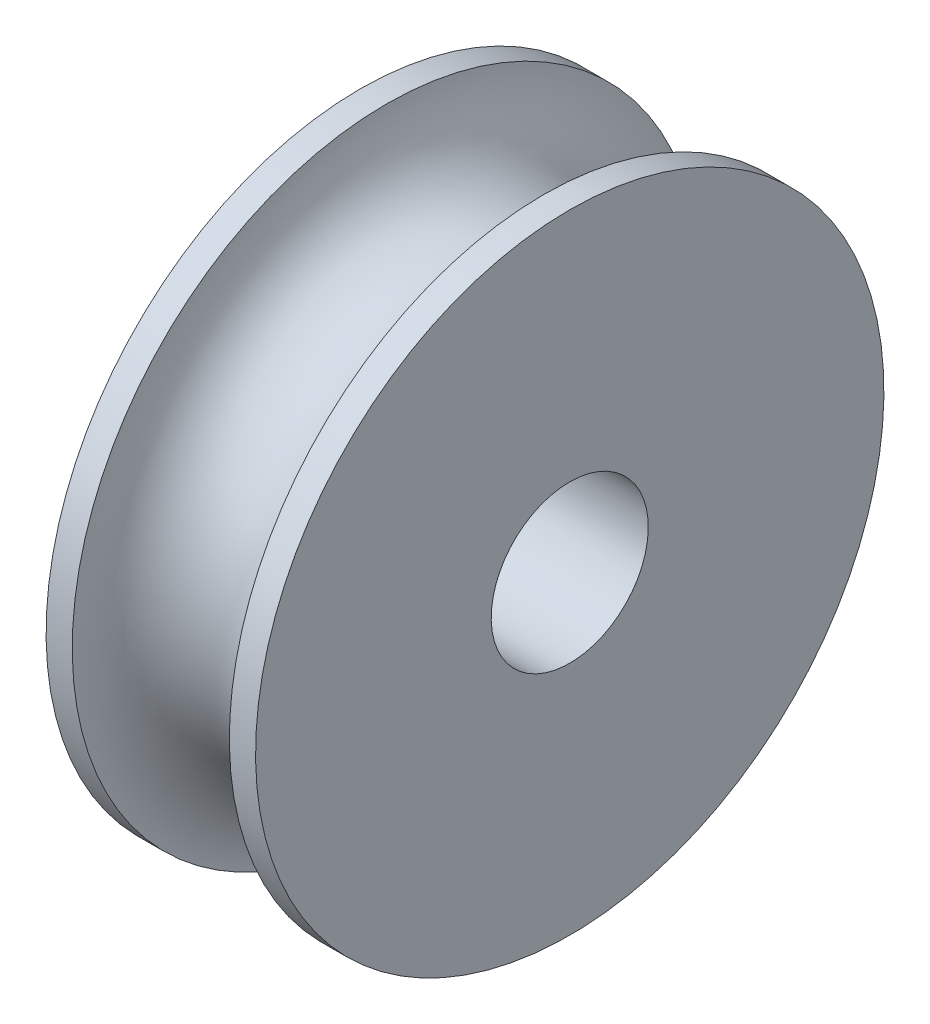
ISO-10303-21;
HEADER;
FILE_DESCRIPTION(('STEP AP214'),'2;1');
FILE_NAME('part.step','',(''),(''),'','','');
FILE_SCHEMA(('AUTOMOTIVE_DESIGN { 1 0 10303 214 1 1 1 1 }'));
ENDSEC;
DATA;
#1=APPLICATION_CONTEXT('core data for automotive mechanical design processes');
#2=APPLICATION_PROTOCOL_DEFINITION('international standard','automotive_design',2000,#1);
#3=PRODUCT_CONTEXT('',#1,'mechanical');
#4=PRODUCT('Part','Part','',(#3));
#5=PRODUCT_RELATED_PRODUCT_CATEGORY('part','',(#4));
#6=PRODUCT_DEFINITION_FORMATION('','',#4);
#7=PRODUCT_DEFINITION_CONTEXT('part definition',#1,'design');
#8=PRODUCT_DEFINITION('design','',#6,#7);
#9=PRODUCT_DEFINITION_SHAPE('','',#8);
#10=(LENGTH_UNIT() NAMED_UNIT(*) SI_UNIT(.MILLI.,.METRE.));
#11=(NAMED_UNIT(*) PLANE_ANGLE_UNIT() SI_UNIT($,.RADIAN.));
#12=(NAMED_UNIT(*) SI_UNIT($,.STERADIAN.) SOLID_ANGLE_UNIT());
#13=UNCERTAINTY_MEASURE_WITH_UNIT(LENGTH_MEASURE(1.E-05),#10,'distance_accuracy_value','');
#14=(GEOMETRIC_REPRESENTATION_CONTEXT(3) GLOBAL_UNCERTAINTY_ASSIGNED_CONTEXT((#13)) GLOBAL_UNIT_ASSIGNED_CONTEXT((#10,
#11,#12)) REPRESENTATION_CONTEXT('',''));
#15=CARTESIAN_POINT('',(0.,0.,0.));
#16=DIRECTION('',(0.,0.,1.));
#17=DIRECTION('',(1.,0.,0.));
#18=AXIS2_PLACEMENT_3D('',#15,#16,#17);
#19=CARTESIAN_POINT('',(0.,0.,0.));
#20=DIRECTION('',(1.,0.,0.));
#21=DIRECTION('',(0.,1.,0.));
#22=AXIS2_PLACEMENT_3D('',#19,#20,#21);
#23=PLANE('',#22);
#24=CARTESIAN_POINT('',(0.,0.,0.));
#25=DIRECTION('',(1.,0.,0.));
#26=DIRECTION('',(0.,1.,0.));
#27=AXIS2_PLACEMENT_3D('',#24,#25,#26);
#28=CIRCLE('',#27,1.5);
#29=CARTESIAN_POINT('',(0.,1.5,0.));
#30=VERTEX_POINT('',#29);
#31=EDGE_CURVE('E60',#30,#30,#28,.T.);
#32=ORIENTED_EDGE('',*,*,#31,.F.);
#33=EDGE_LOOP('',(#32));
#34=FACE_BOUND('',#33,.T.);
#35=CARTESIAN_POINT('',(0.,0.,0.));
#36=DIRECTION('',(1.,0.,0.));
#37=DIRECTION('',(0.,1.,0.));
#38=AXIS2_PLACEMENT_3D('',#35,#36,#37);
#39=CIRCLE('',#38,6.);
#40=CARTESIAN_POINT('',(0.,6.,0.));
#41=VERTEX_POINT('',#40);
#42=EDGE_CURVE('E56',#41,#41,#39,.T.);
#43=ORIENTED_EDGE('',*,*,#42,.T.);
#44=EDGE_LOOP('',(#43));
#45=FACE_BOUND('',#44,.T.);
#46=ADVANCED_FACE('F37',(#34,#45),#23,.T.);
#47=CARTESIAN_POINT('',(-4.,0.,0.));
#48=DIRECTION('',(-1.,0.,0.));
#49=DIRECTION('',(0.,-1.,0.));
#50=AXIS2_PLACEMENT_3D('',#47,#48,#49);
#51=PLANE('',#50);
#52=CARTESIAN_POINT('',(-4.,0.,0.));
#53=DIRECTION('',(-1.,0.,0.));
#54=DIRECTION('',(0.,-1.,0.));
#55=AXIS2_PLACEMENT_3D('',#52,#53,#54);
#56=CIRCLE('',#55,1.5);
#57=CARTESIAN_POINT('',(-4.,-1.5,0.));
#58=VERTEX_POINT('',#57);
#59=EDGE_CURVE('E40',#58,#58,#56,.T.);
#60=ORIENTED_EDGE('',*,*,#59,.F.);
#61=EDGE_LOOP('',(#60));
#62=FACE_BOUND('',#61,.T.);
#63=CARTESIAN_POINT('',(-4.,0.,0.));
#64=DIRECTION('',(1.,0.,0.));
#65=DIRECTION('',(0.,1.,0.));
#66=AXIS2_PLACEMENT_3D('',#63,#64,#65);
#67=CIRCLE('',#66,6.);
#68=CARTESIAN_POINT('',(-4.,6.,0.));
#69=VERTEX_POINT('',#68);
#70=EDGE_CURVE('E10',#69,#69,#67,.T.);
#71=ORIENTED_EDGE('',*,*,#70,.F.);
#72=EDGE_LOOP('',(#71));
#73=FACE_BOUND('',#72,.T.);
#74=ADVANCED_FACE('F71',(#62,#73),#51,.T.);
#75=CARTESIAN_POINT('',(0.,0.,0.));
#76=DIRECTION('',(1.,0.,0.));
#77=DIRECTION('',(0.,1.,0.));
#78=AXIS2_PLACEMENT_3D('',#75,#76,#77);
#79=CYLINDRICAL_SURFACE('',#78,6.);
#80=ORIENTED_EDGE('',*,*,#70,.T.);
#81=EDGE_LOOP('',(#80));
#82=FACE_BOUND('',#81,.T.);
#83=CARTESIAN_POINT('',(-3.5,0.,0.));
#84=DIRECTION('',(1.,0.,0.));
#85=DIRECTION('',(0.,1.,0.));
#86=AXIS2_PLACEMENT_3D('',#83,#84,#85);
#87=CIRCLE('',#86,6.);
#88=CARTESIAN_POINT('',(-3.5,6.,0.));
#89=VERTEX_POINT('',#88);
#90=EDGE_CURVE('E45',#89,#89,#87,.T.);
#91=ORIENTED_EDGE('',*,*,#90,.F.);
#92=EDGE_LOOP('',(#91));
#93=FACE_BOUND('',#92,.T.);
#94=ADVANCED_FACE('F74',(#82,#93),#79,.T.);
#95=CARTESIAN_POINT('',(-2.,0.,0.));
#96=DIRECTION('',(1.,0.,0.));
#97=DIRECTION('',(0.,1.,0.));
#98=AXIS2_PLACEMENT_3D('',#95,#96,#97);
#99=TOROIDAL_SURFACE('',#98,6.,1.5);
#100=ORIENTED_EDGE('',*,*,#90,.T.);
#101=EDGE_LOOP('',(#100));
#102=FACE_BOUND('',#101,.T.);
#103=CARTESIAN_POINT('',(-0.499999999999999,0.,0.));
#104=DIRECTION('',(1.,0.,0.));
#105=DIRECTION('',(0.,1.,0.));
#106=AXIS2_PLACEMENT_3D('',#103,#104,#105);
#107=CIRCLE('',#106,6.);
#108=CARTESIAN_POINT('',(-0.5,6.,0.));
#109=VERTEX_POINT('',#108);
#110=EDGE_CURVE('E50',#109,#109,#107,.T.);
#111=ORIENTED_EDGE('',*,*,#110,.F.);
#112=EDGE_LOOP('',(#111));
#113=FACE_BOUND('',#112,.T.);
#114=ADVANCED_FACE('F79',(#102,#113),#99,.F.);
#115=CARTESIAN_POINT('',(0.,0.,0.));
#116=DIRECTION('',(1.,0.,0.));
#117=DIRECTION('',(0.,1.,0.));
#118=AXIS2_PLACEMENT_3D('',#115,#116,#117);
#119=CYLINDRICAL_SURFACE('',#118,6.);
#120=ORIENTED_EDGE('',*,*,#110,.T.);
#121=EDGE_LOOP('',(#120));
#122=FACE_BOUND('',#121,.T.);
#123=ORIENTED_EDGE('',*,*,#42,.F.);
#124=EDGE_LOOP('',(#123));
#125=FACE_BOUND('',#124,.T.);
#126=ADVANCED_FACE('F85',(#122,#125),#119,.T.);
#127=CARTESIAN_POINT('',(-10.,0.,0.));
#128=DIRECTION('',(1.,0.,0.));
#129=DIRECTION('',(0.,1.,0.));
#130=AXIS2_PLACEMENT_3D('',#127,#128,#129);
#131=CYLINDRICAL_SURFACE('',#130,1.5);
#132=ORIENTED_EDGE('',*,*,#59,.T.);
#133=EDGE_LOOP('',(#132));
#134=FACE_BOUND('',#133,.T.);
#135=ORIENTED_EDGE('',*,*,#31,.T.);
#136=EDGE_LOOP('',(#135));
#137=FACE_BOUND('',#136,.T.);
#138=ADVANCED_FACE('F69',(#134,#137),#131,.F.);
#139=CLOSED_SHELL('',(#46,#74,#94,#114,#126,#138));
#140=MANIFOLD_SOLID_BREP('B2',#139);
#141=ADVANCED_BREP_SHAPE_REPRESENTATION('',(#18,#140),#14);
#142=SHAPE_DEFINITION_REPRESENTATION(#9,#141);
ENDSEC;
END-ISO-10303-21;
